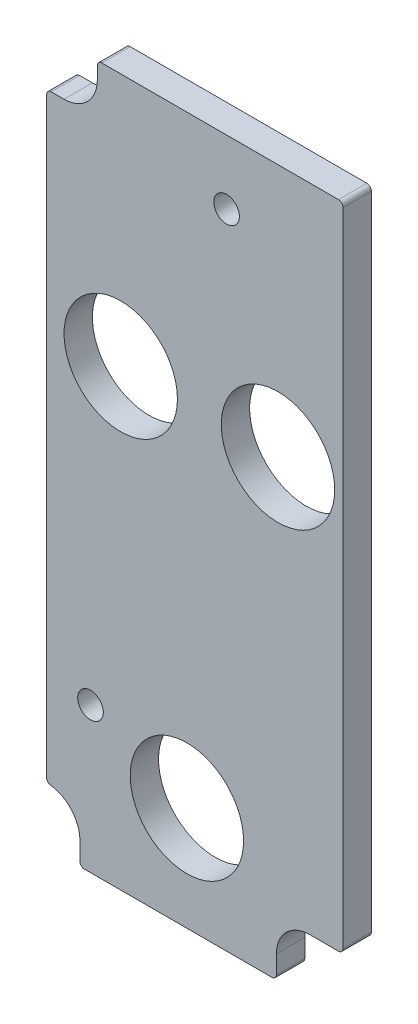
ISO-10303-21;
HEADER;
FILE_DESCRIPTION(('STEP AP214'),'2;1');
FILE_NAME('part.step','',(''),(''),'','','');
FILE_SCHEMA(('AUTOMOTIVE_DESIGN { 1 0 10303 214 1 1 1 1 }'));
ENDSEC;
DATA;
#1=APPLICATION_CONTEXT('core data for automotive mechanical design processes');
#2=APPLICATION_PROTOCOL_DEFINITION('international standard','automotive_design',2000,#1);
#3=PRODUCT_CONTEXT('',#1,'mechanical');
#4=PRODUCT('Part','Part','',(#3));
#5=PRODUCT_RELATED_PRODUCT_CATEGORY('part','',(#4));
#6=PRODUCT_DEFINITION_FORMATION('','',#4);
#7=PRODUCT_DEFINITION_CONTEXT('part definition',#1,'design');
#8=PRODUCT_DEFINITION('design','',#6,#7);
#9=PRODUCT_DEFINITION_SHAPE('','',#8);
#10=(LENGTH_UNIT() NAMED_UNIT(*) SI_UNIT(.MILLI.,.METRE.));
#11=(NAMED_UNIT(*) PLANE_ANGLE_UNIT() SI_UNIT($,.RADIAN.));
#12=(NAMED_UNIT(*) SI_UNIT($,.STERADIAN.) SOLID_ANGLE_UNIT());
#13=UNCERTAINTY_MEASURE_WITH_UNIT(LENGTH_MEASURE(1.E-05),#10,'distance_accuracy_value','');
#14=(GEOMETRIC_REPRESENTATION_CONTEXT(3) GLOBAL_UNCERTAINTY_ASSIGNED_CONTEXT((#13)) GLOBAL_UNIT_ASSIGNED_CONTEXT((#10,
#11,#12)) REPRESENTATION_CONTEXT('',''));
#15=CARTESIAN_POINT('',(0.,0.,0.));
#16=DIRECTION('',(0.,0.,1.));
#17=DIRECTION('',(1.,0.,0.));
#18=AXIS2_PLACEMENT_3D('',#15,#16,#17);
#19=CARTESIAN_POINT('',(-1.524,22.86,4.7625));
#20=DIRECTION('',(0.,0.,-1.));
#21=DIRECTION('',(-1.,0.,0.));
#22=AXIS2_PLACEMENT_3D('',#19,#20,#21);
#23=CYLINDRICAL_SURFACE('',#22,0.761999999999999);
#24=CARTESIAN_POINT('',(-1.524,22.86,0.));
#25=DIRECTION('',(0.,0.,1.));
#26=DIRECTION('',(1.,0.,0.));
#27=AXIS2_PLACEMENT_3D('',#24,#25,#26);
#28=CIRCLE('',#27,0.761999999999999);
#29=CARTESIAN_POINT('',(-1.524,22.098,0.));
#30=VERTEX_POINT('',#29);
#31=CARTESIAN_POINT('',(-0.761999999999998,22.86,0.));
#32=VERTEX_POINT('',#31);
#33=EDGE_CURVE('E221',#30,#32,#28,.T.);
#34=ORIENTED_EDGE('',*,*,#33,.T.);
#35=DIRECTION('',(0.,0.,-1.));
#36=VECTOR('',#35,1.);
#37=CARTESIAN_POINT('',(-0.761999999999998,22.86,4.7625));
#38=LINE('',#37,#36);
#39=CARTESIAN_POINT('',(-0.761999999999998,22.86,4.7625));
#40=VERTEX_POINT('',#39);
#41=EDGE_CURVE('E11',#40,#32,#38,.T.);
#42=ORIENTED_EDGE('',*,*,#41,.F.);
#43=CARTESIAN_POINT('',(-1.524,22.86,4.7625));
#44=DIRECTION('',(0.,0.,1.));
#45=DIRECTION('',(1.,0.,0.));
#46=AXIS2_PLACEMENT_3D('',#43,#44,#45);
#47=CIRCLE('',#46,0.761999999999999);
#48=CARTESIAN_POINT('',(-1.524,22.098,4.7625));
#49=VERTEX_POINT('',#48);
#50=EDGE_CURVE('E270',#49,#40,#47,.T.);
#51=ORIENTED_EDGE('',*,*,#50,.F.);
#52=DIRECTION('',(0.,0.,-1.));
#53=VECTOR('',#52,1.);
#54=CARTESIAN_POINT('',(-1.524,22.098,4.7625));
#55=LINE('',#54,#53);
#56=EDGE_CURVE('E217',#49,#30,#55,.T.);
#57=ORIENTED_EDGE('',*,*,#56,.T.);
#58=EDGE_LOOP('',(#34,#42,#51,#57));
#59=FACE_BOUND('',#58,.T.);
#60=ADVANCED_FACE('F36',(#59),#23,.T.);
#61=CARTESIAN_POINT('',(-0.761999999999998,22.86,4.7625));
#62=DIRECTION('',(-1.,0.,0.));
#63=DIRECTION('',(0.,-1.,0.));
#64=AXIS2_PLACEMENT_3D('',#61,#62,#63);
#65=PLANE('',#64);
#66=DIRECTION('',(0.,1.,0.));
#67=VECTOR('',#66,1.);
#68=CARTESIAN_POINT('',(-0.761999999999998,22.86,0.));
#69=LINE('',#68,#67);
#70=CARTESIAN_POINT('',(-0.761999999999996,130.683,0.));
#71=VERTEX_POINT('',#70);
#72=EDGE_CURVE('E225',#32,#71,#69,.T.);
#73=ORIENTED_EDGE('',*,*,#72,.T.);
#74=DIRECTION('',(0.,0.,-1.));
#75=VECTOR('',#74,1.);
#76=CARTESIAN_POINT('',(-0.761999999999996,130.683,4.7625));
#77=LINE('',#76,#75);
#78=CARTESIAN_POINT('',(-0.761999999999996,130.683,4.7625));
#79=VERTEX_POINT('',#78);
#80=EDGE_CURVE('E44',#79,#71,#77,.T.);
#81=ORIENTED_EDGE('',*,*,#80,.F.);
#82=DIRECTION('',(0.,1.,0.));
#83=VECTOR('',#82,1.);
#84=CARTESIAN_POINT('',(-0.761999999999998,22.86,4.7625));
#85=LINE('',#84,#83);
#86=EDGE_CURVE('E140',#40,#79,#85,.T.);
#87=ORIENTED_EDGE('',*,*,#86,.F.);
#88=ORIENTED_EDGE('',*,*,#41,.T.);
#89=EDGE_LOOP('',(#73,#81,#87,#88));
#90=FACE_BOUND('',#89,.T.);
#91=ADVANCED_FACE('F416',(#90),#65,.F.);
#92=CARTESIAN_POINT('',(-1.52399999999998,130.683,4.7625));
#93=DIRECTION('',(0.,0.,-1.));
#94=DIRECTION('',(-1.,0.,0.));
#95=AXIS2_PLACEMENT_3D('',#92,#93,#94);
#96=CYLINDRICAL_SURFACE('',#95,0.761999999999989);
#97=CARTESIAN_POINT('',(-1.52399999999998,130.683,0.));
#98=DIRECTION('',(0.,0.,1.));
#99=DIRECTION('',(1.,0.,0.));
#100=AXIS2_PLACEMENT_3D('',#97,#98,#99);
#101=CIRCLE('',#100,0.761999999999989);
#102=CARTESIAN_POINT('',(-1.52399999999998,131.445,0.));
#103=VERTEX_POINT('',#102);
#104=EDGE_CURVE('E229',#71,#103,#101,.T.);
#105=ORIENTED_EDGE('',*,*,#104,.T.);
#106=DIRECTION('',(0.,0.,-1.));
#107=VECTOR('',#106,1.);
#108=CARTESIAN_POINT('',(-1.52399999999998,131.445,4.7625));
#109=LINE('',#108,#107);
#110=CARTESIAN_POINT('',(-1.52399999999998,131.445,4.7625));
#111=VERTEX_POINT('',#110);
#112=EDGE_CURVE('E317',#111,#103,#109,.T.);
#113=ORIENTED_EDGE('',*,*,#112,.F.);
#114=CARTESIAN_POINT('',(-1.52399999999998,130.683,4.7625));
#115=DIRECTION('',(0.,0.,1.));
#116=DIRECTION('',(1.,0.,0.));
#117=AXIS2_PLACEMENT_3D('',#114,#115,#116);
#118=CIRCLE('',#117,0.761999999999989);
#119=EDGE_CURVE('E325',#79,#111,#118,.T.);
#120=ORIENTED_EDGE('',*,*,#119,.F.);
#121=ORIENTED_EDGE('',*,*,#80,.T.);
#122=EDGE_LOOP('',(#105,#113,#120,#121));
#123=FACE_BOUND('',#122,.T.);
#124=ADVANCED_FACE('F323',(#123),#96,.T.);
#125=CARTESIAN_POINT('',(-1.52399999999998,131.445,4.7625));
#126=DIRECTION('',(0.,-1.,0.));
#127=DIRECTION('',(0.,0.,-1.));
#128=AXIS2_PLACEMENT_3D('',#125,#126,#127);
#129=PLANE('',#128);
#130=DIRECTION('',(-1.,0.,0.));
#131=VECTOR('',#130,1.);
#132=CARTESIAN_POINT('',(-1.52399999999998,131.445,0.));
#133=LINE('',#132,#131);
#134=CARTESIAN_POINT('',(-41.275,131.445,0.));
#135=VERTEX_POINT('',#134);
#136=EDGE_CURVE('E231',#103,#135,#133,.T.);
#137=ORIENTED_EDGE('',*,*,#136,.T.);
#138=DIRECTION('',(0.,0.,-1.));
#139=VECTOR('',#138,1.);
#140=CARTESIAN_POINT('',(-41.275,131.445,4.7625));
#141=LINE('',#140,#139);
#142=CARTESIAN_POINT('',(-41.275,131.445,4.7625));
#143=VERTEX_POINT('',#142);
#144=EDGE_CURVE('E314',#143,#135,#141,.T.);
#145=ORIENTED_EDGE('',*,*,#144,.F.);
#146=DIRECTION('',(-1.,0.,0.));
#147=VECTOR('',#146,1.);
#148=CARTESIAN_POINT('',(-1.52399999999998,131.445,4.7625));
#149=LINE('',#148,#147);
#150=EDGE_CURVE('E343',#111,#143,#149,.T.);
#151=ORIENTED_EDGE('',*,*,#150,.F.);
#152=ORIENTED_EDGE('',*,*,#112,.T.);
#153=EDGE_LOOP('',(#137,#145,#151,#152));
#154=FACE_BOUND('',#153,.T.);
#155=ADVANCED_FACE('F334',(#154),#129,.F.);
#156=CARTESIAN_POINT('',(-41.275,130.683,4.7625));
#157=DIRECTION('',(0.,0.,-1.));
#158=DIRECTION('',(-1.,0.,0.));
#159=AXIS2_PLACEMENT_3D('',#156,#157,#158);
#160=CYLINDRICAL_SURFACE('',#159,0.761999999999988);
#161=CARTESIAN_POINT('',(-41.275,130.683,0.));
#162=DIRECTION('',(0.,0.,1.));
#163=DIRECTION('',(1.,0.,0.));
#164=AXIS2_PLACEMENT_3D('',#161,#162,#163);
#165=CIRCLE('',#164,0.761999999999988);
#166=CARTESIAN_POINT('',(-42.037,130.683,0.));
#167=VERTEX_POINT('',#166);
#168=EDGE_CURVE('E233',#135,#167,#165,.T.);
#169=ORIENTED_EDGE('',*,*,#168,.T.);
#170=DIRECTION('',(0.,0.,-1.));
#171=VECTOR('',#170,1.);
#172=CARTESIAN_POINT('',(-42.037,130.683,4.7625));
#173=LINE('',#172,#171);
#174=CARTESIAN_POINT('',(-42.037,130.683,4.7625));
#175=VERTEX_POINT('',#174);
#176=EDGE_CURVE('E311',#175,#167,#173,.T.);
#177=ORIENTED_EDGE('',*,*,#176,.F.);
#178=CARTESIAN_POINT('',(-41.275,130.683,4.7625));
#179=DIRECTION('',(0.,0.,1.));
#180=DIRECTION('',(1.,0.,0.));
#181=AXIS2_PLACEMENT_3D('',#178,#179,#180);
#182=CIRCLE('',#181,0.761999999999988);
#183=EDGE_CURVE('E340',#143,#175,#182,.T.);
#184=ORIENTED_EDGE('',*,*,#183,.F.);
#185=ORIENTED_EDGE('',*,*,#144,.T.);
#186=EDGE_LOOP('',(#169,#177,#184,#185));
#187=FACE_BOUND('',#186,.T.);
#188=ADVANCED_FACE('F338',(#187),#160,.T.);
#189=CARTESIAN_POINT('',(-42.037,130.683,4.7625));
#190=DIRECTION('',(1.,0.,0.));
#191=DIRECTION('',(0.,1.,0.));
#192=AXIS2_PLACEMENT_3D('',#189,#190,#191);
#193=PLANE('',#192);
#194=DIRECTION('',(0.,-1.,0.));
#195=VECTOR('',#194,1.);
#196=CARTESIAN_POINT('',(-42.037,130.683,0.));
#197=LINE('',#196,#195);
#198=CARTESIAN_POINT('',(-42.037,128.5875,0.));
#199=VERTEX_POINT('',#198);
#200=EDGE_CURVE('E235',#167,#199,#197,.T.);
#201=ORIENTED_EDGE('',*,*,#200,.T.);
#202=DIRECTION('',(0.,0.,-1.));
#203=VECTOR('',#202,1.);
#204=CARTESIAN_POINT('',(-42.037,128.5875,4.7625));
#205=LINE('',#204,#203);
#206=CARTESIAN_POINT('',(-42.037,128.5875,4.7625));
#207=VERTEX_POINT('',#206);
#208=EDGE_CURVE('E308',#207,#199,#205,.T.);
#209=ORIENTED_EDGE('',*,*,#208,.F.);
#210=DIRECTION('',(0.,-1.,0.));
#211=VECTOR('',#210,1.);
#212=CARTESIAN_POINT('',(-42.037,130.683,4.7625));
#213=LINE('',#212,#211);
#214=EDGE_CURVE('E342',#175,#207,#213,.T.);
#215=ORIENTED_EDGE('',*,*,#214,.F.);
#216=ORIENTED_EDGE('',*,*,#176,.T.);
#217=EDGE_LOOP('',(#201,#209,#215,#216));
#218=FACE_BOUND('',#217,.T.);
#219=ADVANCED_FACE('F428',(#218),#193,.F.);
#220=CARTESIAN_POINT('',(-47.625,128.5875,4.7625));
#221=DIRECTION('',(0.,0.,-1.));
#222=DIRECTION('',(-1.,0.,0.));
#223=AXIS2_PLACEMENT_3D('',#220,#221,#222);
#224=CYLINDRICAL_SURFACE('',#223,5.58799999999998);
#225=CARTESIAN_POINT('',(-47.625,128.5875,0.));
#226=DIRECTION('',(0.,0.,-1.));
#227=DIRECTION('',(1.,0.,0.));
#228=AXIS2_PLACEMENT_3D('',#225,#226,#227);
#229=CIRCLE('',#228,5.58799999999998);
#230=CARTESIAN_POINT('',(-47.625,122.9995,0.));
#231=VERTEX_POINT('',#230);
#232=EDGE_CURVE('E237',#199,#231,#229,.T.);
#233=ORIENTED_EDGE('',*,*,#232,.T.);
#234=DIRECTION('',(0.,0.,-1.));
#235=VECTOR('',#234,1.);
#236=CARTESIAN_POINT('',(-47.625,122.9995,4.7625));
#237=LINE('',#236,#235);
#238=CARTESIAN_POINT('',(-47.625,122.9995,4.7625));
#239=VERTEX_POINT('',#238);
#240=EDGE_CURVE('E305',#239,#231,#237,.T.);
#241=ORIENTED_EDGE('',*,*,#240,.F.);
#242=CARTESIAN_POINT('',(-47.625,128.5875,4.7625));
#243=DIRECTION('',(0.,0.,-1.));
#244=DIRECTION('',(1.,0.,0.));
#245=AXIS2_PLACEMENT_3D('',#242,#243,#244);
#246=CIRCLE('',#245,5.58799999999998);
#247=EDGE_CURVE('E345',#207,#239,#246,.T.);
#248=ORIENTED_EDGE('',*,*,#247,.F.);
#249=ORIENTED_EDGE('',*,*,#208,.T.);
#250=EDGE_LOOP('',(#233,#241,#248,#249));
#251=FACE_BOUND('',#250,.T.);
#252=ADVANCED_FACE('F431',(#251),#224,.F.);
#253=CARTESIAN_POINT('',(-47.625,122.9995,4.7625));
#254=DIRECTION('',(0.,-1.,0.));
#255=DIRECTION('',(1.,0.,0.));
#256=AXIS2_PLACEMENT_3D('',#253,#254,#255);
#257=PLANE('',#256);
#258=DIRECTION('',(-1.,0.,0.));
#259=VECTOR('',#258,1.);
#260=CARTESIAN_POINT('',(-47.625,122.9995,0.));
#261=LINE('',#260,#259);
#262=CARTESIAN_POINT('',(-49.784,122.9995,0.));
#263=VERTEX_POINT('',#262);
#264=EDGE_CURVE('E239',#231,#263,#261,.T.);
#265=ORIENTED_EDGE('',*,*,#264,.T.);
#266=DIRECTION('',(0.,0.,-1.));
#267=VECTOR('',#266,1.);
#268=CARTESIAN_POINT('',(-49.784,122.9995,4.7625));
#269=LINE('',#268,#267);
#270=CARTESIAN_POINT('',(-49.784,122.9995,4.7625));
#271=VERTEX_POINT('',#270);
#272=EDGE_CURVE('E302',#271,#263,#269,.T.);
#273=ORIENTED_EDGE('',*,*,#272,.F.);
#274=DIRECTION('',(-1.,0.,0.));
#275=VECTOR('',#274,1.);
#276=CARTESIAN_POINT('',(-47.625,122.9995,4.7625));
#277=LINE('',#276,#275);
#278=EDGE_CURVE('E351',#239,#271,#277,.T.);
#279=ORIENTED_EDGE('',*,*,#278,.F.);
#280=ORIENTED_EDGE('',*,*,#240,.T.);
#281=EDGE_LOOP('',(#265,#273,#279,#280));
#282=FACE_BOUND('',#281,.T.);
#283=ADVANCED_FACE('F435',(#282),#257,.F.);
#284=CARTESIAN_POINT('',(-49.784,122.2375,4.7625));
#285=DIRECTION('',(0.,0.,-1.));
#286=DIRECTION('',(-1.,0.,0.));
#287=AXIS2_PLACEMENT_3D('',#284,#285,#286);
#288=CYLINDRICAL_SURFACE('',#287,0.76200000000002);
#289=CARTESIAN_POINT('',(-49.784,122.2375,0.));
#290=DIRECTION('',(0.,0.,1.));
#291=DIRECTION('',(1.,0.,0.));
#292=AXIS2_PLACEMENT_3D('',#289,#290,#291);
#293=CIRCLE('',#292,0.76200000000002);
#294=CARTESIAN_POINT('',(-50.546,122.2375,0.));
#295=VERTEX_POINT('',#294);
#296=EDGE_CURVE('E241',#263,#295,#293,.T.);
#297=ORIENTED_EDGE('',*,*,#296,.T.);
#298=DIRECTION('',(0.,0.,-1.));
#299=VECTOR('',#298,1.);
#300=CARTESIAN_POINT('',(-50.546,122.2375,4.7625));
#301=LINE('',#300,#299);
#302=CARTESIAN_POINT('',(-50.546,122.2375,4.7625));
#303=VERTEX_POINT('',#302);
#304=EDGE_CURVE('E299',#303,#295,#301,.T.);
#305=ORIENTED_EDGE('',*,*,#304,.F.);
#306=CARTESIAN_POINT('',(-49.784,122.2375,4.7625));
#307=DIRECTION('',(0.,0.,1.));
#308=DIRECTION('',(1.,0.,0.));
#309=AXIS2_PLACEMENT_3D('',#306,#307,#308);
#310=CIRCLE('',#309,0.76200000000002);
#311=EDGE_CURVE('E353',#271,#303,#310,.T.);
#312=ORIENTED_EDGE('',*,*,#311,.F.);
#313=ORIENTED_EDGE('',*,*,#272,.T.);
#314=EDGE_LOOP('',(#297,#305,#312,#313));
#315=FACE_BOUND('',#314,.T.);
#316=ADVANCED_FACE('F439',(#315),#288,.T.);
#317=CARTESIAN_POINT('',(-50.546,122.2375,4.7625));
#318=DIRECTION('',(1.,0.,0.));
#319=DIRECTION('',(0.,1.,0.));
#320=AXIS2_PLACEMENT_3D('',#317,#318,#319);
#321=PLANE('',#320);
#322=DIRECTION('',(0.,-1.,0.));
#323=VECTOR('',#322,1.);
#324=CARTESIAN_POINT('',(-50.546,122.2375,0.));
#325=LINE('',#324,#323);
#326=CARTESIAN_POINT('',(-50.546,22.8141142121634,0.));
#327=VERTEX_POINT('',#326);
#328=EDGE_CURVE('E243',#295,#327,#325,.T.);
#329=ORIENTED_EDGE('',*,*,#328,.T.);
#330=DIRECTION('',(0.,0.,-1.));
#331=VECTOR('',#330,1.);
#332=CARTESIAN_POINT('',(-50.546,22.8141142121634,4.7625));
#333=LINE('',#332,#331);
#334=CARTESIAN_POINT('',(-50.546,22.8141142121634,4.7625));
#335=VERTEX_POINT('',#334);
#336=EDGE_CURVE('E295',#335,#327,#333,.T.);
#337=ORIENTED_EDGE('',*,*,#336,.F.);
#338=DIRECTION('',(0.,-1.,0.));
#339=VECTOR('',#338,1.);
#340=CARTESIAN_POINT('',(-50.546,122.2375,4.7625));
#341=LINE('',#340,#339);
#342=EDGE_CURVE('E355',#303,#335,#341,.T.);
#343=ORIENTED_EDGE('',*,*,#342,.F.);
#344=ORIENTED_EDGE('',*,*,#304,.T.);
#345=EDGE_LOOP('',(#329,#337,#343,#344));
#346=FACE_BOUND('',#345,.T.);
#347=ADVANCED_FACE('F443',(#346),#321,.F.);
#348=CARTESIAN_POINT('',(-49.784,22.8141142121634,4.7625));
#349=DIRECTION('',(0.,0.,-1.));
#350=DIRECTION('',(-1.,0.,0.));
#351=AXIS2_PLACEMENT_3D('',#348,#349,#350);
#352=CYLINDRICAL_SURFACE('',#351,0.762000000000004);
#353=CARTESIAN_POINT('',(-49.784,22.8141142121634,0.));
#354=DIRECTION('',(0.,0.,1.));
#355=DIRECTION('',(1.,0.,0.));
#356=AXIS2_PLACEMENT_3D('',#353,#354,#355);
#357=CIRCLE('',#356,0.762000000000004);
#358=CARTESIAN_POINT('',(-49.87544,22.0576205067037,0.));
#359=VERTEX_POINT('',#358);
#360=EDGE_CURVE('E246',#327,#359,#357,.T.);
#361=ORIENTED_EDGE('',*,*,#360,.T.);
#362=DIRECTION('',(0.,0.,-1.));
#363=VECTOR('',#362,1.);
#364=CARTESIAN_POINT('',(-49.87544,22.0576205067037,4.7625));
#365=LINE('',#364,#363);
#366=CARTESIAN_POINT('',(-49.87544,22.0576205067037,4.7625));
#367=VERTEX_POINT('',#366);
#368=EDGE_CURVE('E291',#367,#359,#365,.T.);
#369=ORIENTED_EDGE('',*,*,#368,.F.);
#370=CARTESIAN_POINT('',(-49.784,22.8141142121634,4.7625));
#371=DIRECTION('',(0.,0.,1.));
#372=DIRECTION('',(1.,0.,0.));
#373=AXIS2_PLACEMENT_3D('',#370,#371,#372);
#374=CIRCLE('',#373,0.762000000000004);
#375=EDGE_CURVE('E358',#335,#367,#374,.T.);
#376=ORIENTED_EDGE('',*,*,#375,.F.);
#377=ORIENTED_EDGE('',*,*,#336,.T.);
#378=EDGE_LOOP('',(#361,#369,#376,#377));
#379=FACE_BOUND('',#378,.T.);
#380=ADVANCED_FACE('F447',(#379),#352,.T.);
#381=CARTESIAN_POINT('',(-50.546,16.51,4.7625));
#382=DIRECTION('',(0.,0.,-1.));
#383=DIRECTION('',(-1.,0.,0.));
#384=AXIS2_PLACEMENT_3D('',#381,#382,#383);
#385=CYLINDRICAL_SURFACE('',#384,5.588);
#386=CARTESIAN_POINT('',(-50.546,16.51,0.));
#387=DIRECTION('',(0.,0.,-1.));
#388=DIRECTION('',(1.,0.,0.));
#389=AXIS2_PLACEMENT_3D('',#386,#387,#388);
#390=CIRCLE('',#389,5.588);
#391=CARTESIAN_POINT('',(-44.958,16.51,0.));
#392=VERTEX_POINT('',#391);
#393=EDGE_CURVE('E249',#359,#392,#390,.T.);
#394=ORIENTED_EDGE('',*,*,#393,.T.);
#395=DIRECTION('',(0.,0.,-1.));
#396=VECTOR('',#395,1.);
#397=CARTESIAN_POINT('',(-44.958,16.51,4.7625));
#398=LINE('',#397,#396);
#399=CARTESIAN_POINT('',(-44.958,16.51,4.7625));
#400=VERTEX_POINT('',#399);
#401=EDGE_CURVE('E287',#400,#392,#398,.T.);
#402=ORIENTED_EDGE('',*,*,#401,.F.);
#403=CARTESIAN_POINT('',(-50.546,16.51,4.7625));
#404=DIRECTION('',(0.,0.,-1.));
#405=DIRECTION('',(1.,0.,0.));
#406=AXIS2_PLACEMENT_3D('',#403,#404,#405);
#407=CIRCLE('',#406,5.588);
#408=EDGE_CURVE('E361',#367,#400,#407,.T.);
#409=ORIENTED_EDGE('',*,*,#408,.F.);
#410=ORIENTED_EDGE('',*,*,#368,.T.);
#411=EDGE_LOOP('',(#394,#402,#409,#410));
#412=FACE_BOUND('',#411,.T.);
#413=ADVANCED_FACE('F451',(#412),#385,.F.);
#414=CARTESIAN_POINT('',(-44.958,16.51,4.7625));
#415=DIRECTION('',(1.,0.,0.));
#416=DIRECTION('',(0.,0.,-1.));
#417=AXIS2_PLACEMENT_3D('',#414,#415,#416);
#418=PLANE('',#417);
#419=DIRECTION('',(0.,-1.,0.));
#420=VECTOR('',#419,1.);
#421=CARTESIAN_POINT('',(-44.958,16.51,0.));
#422=LINE('',#421,#420);
#423=CARTESIAN_POINT('',(-44.958,13.462,0.));
#424=VERTEX_POINT('',#423);
#425=EDGE_CURVE('E252',#392,#424,#422,.T.);
#426=ORIENTED_EDGE('',*,*,#425,.T.);
#427=DIRECTION('',(0.,0.,-1.));
#428=VECTOR('',#427,1.);
#429=CARTESIAN_POINT('',(-44.958,13.462,4.7625));
#430=LINE('',#429,#428);
#431=CARTESIAN_POINT('',(-44.958,13.462,4.7625));
#432=VERTEX_POINT('',#431);
#433=EDGE_CURVE('E283',#432,#424,#430,.T.);
#434=ORIENTED_EDGE('',*,*,#433,.F.);
#435=DIRECTION('',(0.,-1.,0.));
#436=VECTOR('',#435,1.);
#437=CARTESIAN_POINT('',(-44.958,16.51,4.7625));
#438=LINE('',#437,#436);
#439=EDGE_CURVE('E364',#400,#432,#438,.T.);
#440=ORIENTED_EDGE('',*,*,#439,.F.);
#441=ORIENTED_EDGE('',*,*,#401,.T.);
#442=EDGE_LOOP('',(#426,#434,#440,#441));
#443=FACE_BOUND('',#442,.T.);
#444=ADVANCED_FACE('F455',(#443),#418,.F.);
#445=CARTESIAN_POINT('',(-44.196,13.462,4.7625));
#446=DIRECTION('',(0.,0.,-1.));
#447=DIRECTION('',(-1.,0.,0.));
#448=AXIS2_PLACEMENT_3D('',#445,#446,#447);
#449=CYLINDRICAL_SURFACE('',#448,0.761999999999999);
#450=CARTESIAN_POINT('',(-44.196,13.462,0.));
#451=DIRECTION('',(0.,0.,1.));
#452=DIRECTION('',(1.,0.,0.));
#453=AXIS2_PLACEMENT_3D('',#450,#451,#452);
#454=CIRCLE('',#453,0.761999999999999);
#455=CARTESIAN_POINT('',(-44.196,12.7,0.));
#456=VERTEX_POINT('',#455);
#457=EDGE_CURVE('E255',#424,#456,#454,.T.);
#458=ORIENTED_EDGE('',*,*,#457,.T.);
#459=DIRECTION('',(0.,0.,-1.));
#460=VECTOR('',#459,1.);
#461=CARTESIAN_POINT('',(-44.196,12.7,4.7625));
#462=LINE('',#461,#460);
#463=CARTESIAN_POINT('',(-44.196,12.7,4.7625));
#464=VERTEX_POINT('',#463);
#465=EDGE_CURVE('E279',#464,#456,#462,.T.);
#466=ORIENTED_EDGE('',*,*,#465,.F.);
#467=CARTESIAN_POINT('',(-44.196,13.462,4.7625));
#468=DIRECTION('',(0.,0.,1.));
#469=DIRECTION('',(1.,0.,0.));
#470=AXIS2_PLACEMENT_3D('',#467,#468,#469);
#471=CIRCLE('',#470,0.761999999999999);
#472=EDGE_CURVE('E367',#432,#464,#471,.T.);
#473=ORIENTED_EDGE('',*,*,#472,.F.);
#474=ORIENTED_EDGE('',*,*,#433,.T.);
#475=EDGE_LOOP('',(#458,#466,#473,#474));
#476=FACE_BOUND('',#475,.T.);
#477=ADVANCED_FACE('F459',(#476),#449,.T.);
#478=CARTESIAN_POINT('',(-44.196,12.7,4.7625));
#479=DIRECTION('',(0.,1.,0.));
#480=DIRECTION('',(-1.,0.,0.));
#481=AXIS2_PLACEMENT_3D('',#478,#479,#480);
#482=PLANE('',#481);
#483=DIRECTION('',(1.,0.,0.));
#484=VECTOR('',#483,1.);
#485=CARTESIAN_POINT('',(-44.196,12.7,0.));
#486=LINE('',#485,#484);
#487=CARTESIAN_POINT('',(-12.7,12.7,0.));
#488=VERTEX_POINT('',#487);
#489=EDGE_CURVE('E258',#456,#488,#486,.T.);
#490=ORIENTED_EDGE('',*,*,#489,.T.);
#491=DIRECTION('',(0.,0.,-1.));
#492=VECTOR('',#491,1.);
#493=CARTESIAN_POINT('',(-12.7,12.7,4.7625));
#494=LINE('',#493,#492);
#495=CARTESIAN_POINT('',(-12.7,12.7,4.7625));
#496=VERTEX_POINT('',#495);
#497=EDGE_CURVE('E275',#496,#488,#494,.T.);
#498=ORIENTED_EDGE('',*,*,#497,.F.);
#499=DIRECTION('',(1.,0.,0.));
#500=VECTOR('',#499,1.);
#501=CARTESIAN_POINT('',(-44.196,12.7,4.7625));
#502=LINE('',#501,#500);
#503=EDGE_CURVE('E370',#464,#496,#502,.T.);
#504=ORIENTED_EDGE('',*,*,#503,.F.);
#505=ORIENTED_EDGE('',*,*,#465,.T.);
#506=EDGE_LOOP('',(#490,#498,#504,#505));
#507=FACE_BOUND('',#506,.T.);
#508=ADVANCED_FACE('F463',(#507),#482,.F.);
#509=CARTESIAN_POINT('',(-12.7,13.462,4.7625));
#510=DIRECTION('',(0.,0.,-1.));
#511=DIRECTION('',(-1.,0.,0.));
#512=AXIS2_PLACEMENT_3D('',#509,#510,#511);
#513=CYLINDRICAL_SURFACE('',#512,0.761999999999987);
#514=CARTESIAN_POINT('',(-12.7,13.462,0.));
#515=DIRECTION('',(0.,0.,1.));
#516=DIRECTION('',(1.,0.,0.));
#517=AXIS2_PLACEMENT_3D('',#514,#515,#516);
#518=CIRCLE('',#517,0.761999999999987);
#519=CARTESIAN_POINT('',(-11.938,13.462,0.));
#520=VERTEX_POINT('',#519);
#521=EDGE_CURVE('E261',#488,#520,#518,.T.);
#522=ORIENTED_EDGE('',*,*,#521,.T.);
#523=DIRECTION('',(0.,0.,-1.));
#524=VECTOR('',#523,1.);
#525=CARTESIAN_POINT('',(-11.938,13.462,4.7625));
#526=LINE('',#525,#524);
#527=CARTESIAN_POINT('',(-11.938,13.462,4.7625));
#528=VERTEX_POINT('',#527);
#529=EDGE_CURVE('E210',#528,#520,#526,.T.);
#530=ORIENTED_EDGE('',*,*,#529,.F.);
#531=CARTESIAN_POINT('',(-12.7,13.462,4.7625));
#532=DIRECTION('',(0.,0.,1.));
#533=DIRECTION('',(1.,0.,0.));
#534=AXIS2_PLACEMENT_3D('',#531,#532,#533);
#535=CIRCLE('',#534,0.761999999999987);
#536=EDGE_CURVE('E199',#496,#528,#535,.T.);
#537=ORIENTED_EDGE('',*,*,#536,.F.);
#538=ORIENTED_EDGE('',*,*,#497,.T.);
#539=EDGE_LOOP('',(#522,#530,#537,#538));
#540=FACE_BOUND('',#539,.T.);
#541=ADVANCED_FACE('F467',(#540),#513,.T.);
#542=CARTESIAN_POINT('',(-11.938,13.462,4.7625));
#543=DIRECTION('',(-1.,0.,0.));
#544=DIRECTION('',(0.,-1.,0.));
#545=AXIS2_PLACEMENT_3D('',#542,#543,#544);
#546=PLANE('',#545);
#547=DIRECTION('',(0.,1.,0.));
#548=VECTOR('',#547,1.);
#549=CARTESIAN_POINT('',(-11.938,13.462,0.));
#550=LINE('',#549,#548);
#551=CARTESIAN_POINT('',(-11.938,16.51,0.));
#552=VERTEX_POINT('',#551);
#553=EDGE_CURVE('E208',#520,#552,#550,.T.);
#554=ORIENTED_EDGE('',*,*,#553,.T.);
#555=DIRECTION('',(0.,0.,-1.));
#556=VECTOR('',#555,1.);
#557=CARTESIAN_POINT('',(-11.938,16.51,4.7625));
#558=LINE('',#557,#556);
#559=CARTESIAN_POINT('',(-11.938,16.51,4.7625));
#560=VERTEX_POINT('',#559);
#561=EDGE_CURVE('E205',#560,#552,#558,.T.);
#562=ORIENTED_EDGE('',*,*,#561,.F.);
#563=DIRECTION('',(0.,1.,0.));
#564=VECTOR('',#563,1.);
#565=CARTESIAN_POINT('',(-11.938,13.462,4.7625));
#566=LINE('',#565,#564);
#567=EDGE_CURVE('E193',#528,#560,#566,.T.);
#568=ORIENTED_EDGE('',*,*,#567,.F.);
#569=ORIENTED_EDGE('',*,*,#529,.T.);
#570=EDGE_LOOP('',(#554,#562,#568,#569));
#571=FACE_BOUND('',#570,.T.);
#572=ADVANCED_FACE('F206',(#571),#546,.F.);
#573=CARTESIAN_POINT('',(-6.35,16.51,4.7625));
#574=DIRECTION('',(0.,0.,-1.));
#575=DIRECTION('',(-1.,0.,0.));
#576=AXIS2_PLACEMENT_3D('',#573,#574,#575);
#577=CYLINDRICAL_SURFACE('',#576,5.588);
#578=CARTESIAN_POINT('',(-6.35,16.51,0.));
#579=DIRECTION('',(0.,0.,-1.));
#580=DIRECTION('',(1.,0.,0.));
#581=AXIS2_PLACEMENT_3D('',#578,#579,#580);
#582=CIRCLE('',#581,5.588);
#583=CARTESIAN_POINT('',(-6.35,22.098,0.));
#584=VERTEX_POINT('',#583);
#585=EDGE_CURVE('E125',#552,#584,#582,.T.);
#586=ORIENTED_EDGE('',*,*,#585,.T.);
#587=DIRECTION('',(0.,0.,-1.));
#588=VECTOR('',#587,1.);
#589=CARTESIAN_POINT('',(-6.35,22.098,4.7625));
#590=LINE('',#589,#588);
#591=CARTESIAN_POINT('',(-6.35,22.098,4.7625));
#592=VERTEX_POINT('',#591);
#593=EDGE_CURVE('E211',#592,#584,#590,.T.);
#594=ORIENTED_EDGE('',*,*,#593,.F.);
#595=CARTESIAN_POINT('',(-6.35,16.51,4.7625));
#596=DIRECTION('',(0.,0.,-1.));
#597=DIRECTION('',(1.,0.,0.));
#598=AXIS2_PLACEMENT_3D('',#595,#596,#597);
#599=CIRCLE('',#598,5.588);
#600=EDGE_CURVE('E197',#560,#592,#599,.T.);
#601=ORIENTED_EDGE('',*,*,#600,.F.);
#602=ORIENTED_EDGE('',*,*,#561,.T.);
#603=EDGE_LOOP('',(#586,#594,#601,#602));
#604=FACE_BOUND('',#603,.T.);
#605=ADVANCED_FACE('F213',(#604),#577,.F.);
#606=CARTESIAN_POINT('',(-6.35,22.098,4.7625));
#607=DIRECTION('',(0.,1.,0.));
#608=DIRECTION('',(0.,0.,1.));
#609=AXIS2_PLACEMENT_3D('',#606,#607,#608);
#610=PLANE('',#609);
#611=DIRECTION('',(1.,0.,0.));
#612=VECTOR('',#611,1.);
#613=CARTESIAN_POINT('',(-6.35,22.098,0.));
#614=LINE('',#613,#612);
#615=EDGE_CURVE('E132',#584,#30,#614,.T.);
#616=ORIENTED_EDGE('',*,*,#615,.T.);
#617=ORIENTED_EDGE('',*,*,#56,.F.);
#618=DIRECTION('',(1.,0.,0.));
#619=VECTOR('',#618,1.);
#620=CARTESIAN_POINT('',(-6.35,22.098,4.7625));
#621=LINE('',#620,#619);
#622=EDGE_CURVE('E52',#592,#49,#621,.T.);
#623=ORIENTED_EDGE('',*,*,#622,.F.);
#624=ORIENTED_EDGE('',*,*,#593,.T.);
#625=EDGE_LOOP('',(#616,#617,#623,#624));
#626=FACE_BOUND('',#625,.T.);
#627=ADVANCED_FACE('F476',(#626),#610,.F.);
#628=CARTESIAN_POINT('',(-1.524,22.86,4.7625));
#629=DIRECTION('',(0.,0.,1.));
#630=DIRECTION('',(1.,0.,0.));
#631=AXIS2_PLACEMENT_3D('',#628,#629,#630);
#632=PLANE('',#631);
#633=CARTESIAN_POINT('',(-20.32,120.65,4.7625));
#634=DIRECTION('',(0.,0.,1.));
#635=DIRECTION('',(1.,0.,0.));
#636=AXIS2_PLACEMENT_3D('',#633,#634,#635);
#637=CIRCLE('',#636,2.15265);
#638=CARTESIAN_POINT('',(-18.16735,120.65,4.7625));
#639=VERTEX_POINT('',#638);
#640=EDGE_CURVE('E394',#639,#639,#637,.T.);
#641=ORIENTED_EDGE('',*,*,#640,.F.);
#642=EDGE_LOOP('',(#641));
#643=FACE_BOUND('',#642,.T.);
#644=CARTESIAN_POINT('',(-43.18,37.084,4.7625));
#645=DIRECTION('',(0.,0.,1.));
#646=DIRECTION('',(1.,0.,0.));
#647=AXIS2_PLACEMENT_3D('',#644,#645,#646);
#648=CIRCLE('',#647,2.15264999999999);
#649=CARTESIAN_POINT('',(-41.02735,37.084,4.7625));
#650=VERTEX_POINT('',#649);
#651=EDGE_CURVE('E377',#650,#650,#648,.T.);
#652=ORIENTED_EDGE('',*,*,#651,.F.);
#653=EDGE_LOOP('',(#652));
#654=FACE_BOUND('',#653,.T.);
#655=CARTESIAN_POINT('',(-38.1,88.9,4.7625));
#656=DIRECTION('',(0.,0.,1.));
#657=DIRECTION('',(1.,0.,0.));
#658=AXIS2_PLACEMENT_3D('',#655,#656,#657);
#659=CIRCLE('',#658,9.525);
#660=CARTESIAN_POINT('',(-28.575,88.9,4.7625));
#661=VERTEX_POINT('',#660);
#662=EDGE_CURVE('E376',#661,#661,#659,.T.);
#663=ORIENTED_EDGE('',*,*,#662,.F.);
#664=EDGE_LOOP('',(#663));
#665=FACE_BOUND('',#664,.T.);
#666=CARTESIAN_POINT('',(-11.684,88.9,4.7625));
#667=DIRECTION('',(0.,0.,1.));
#668=DIRECTION('',(1.,0.,0.));
#669=AXIS2_PLACEMENT_3D('',#666,#667,#668);
#670=CIRCLE('',#669,9.525);
#671=CARTESIAN_POINT('',(-2.159,88.9,4.7625));
#672=VERTEX_POINT('',#671);
#673=EDGE_CURVE('E405',#672,#672,#670,.T.);
#674=ORIENTED_EDGE('',*,*,#673,.F.);
#675=EDGE_LOOP('',(#674));
#676=FACE_BOUND('',#675,.T.);
#677=CARTESIAN_POINT('',(-26.9875,30.1625,4.7625));
#678=DIRECTION('',(0.,0.,1.));
#679=DIRECTION('',(1.,0.,0.));
#680=AXIS2_PLACEMENT_3D('',#677,#678,#679);
#681=CIRCLE('',#680,9.525);
#682=CARTESIAN_POINT('',(-17.4625,30.1625,4.7625));
#683=VERTEX_POINT('',#682);
#684=EDGE_CURVE('E381',#683,#683,#681,.T.);
#685=ORIENTED_EDGE('',*,*,#684,.F.);
#686=EDGE_LOOP('',(#685));
#687=FACE_BOUND('',#686,.T.);
#688=ORIENTED_EDGE('',*,*,#50,.T.);
#689=ORIENTED_EDGE('',*,*,#86,.T.);
#690=ORIENTED_EDGE('',*,*,#119,.T.);
#691=ORIENTED_EDGE('',*,*,#150,.T.);
#692=ORIENTED_EDGE('',*,*,#183,.T.);
#693=ORIENTED_EDGE('',*,*,#214,.T.);
#694=ORIENTED_EDGE('',*,*,#247,.T.);
#695=ORIENTED_EDGE('',*,*,#278,.T.);
#696=ORIENTED_EDGE('',*,*,#311,.T.);
#697=ORIENTED_EDGE('',*,*,#342,.T.);
#698=ORIENTED_EDGE('',*,*,#375,.T.);
#699=ORIENTED_EDGE('',*,*,#408,.T.);
#700=ORIENTED_EDGE('',*,*,#439,.T.);
#701=ORIENTED_EDGE('',*,*,#472,.T.);
#702=ORIENTED_EDGE('',*,*,#503,.T.);
#703=ORIENTED_EDGE('',*,*,#536,.T.);
#704=ORIENTED_EDGE('',*,*,#567,.T.);
#705=ORIENTED_EDGE('',*,*,#600,.T.);
#706=ORIENTED_EDGE('',*,*,#622,.T.);
#707=EDGE_LOOP('',(#688,#689,#690,#691,#692,#693,#694,#695,#696,#697,#698,#699,#700,#701,#702,
#703,#704,#705,#706));
#708=FACE_BOUND('',#707,.T.);
#709=ADVANCED_FACE('F195',(#643,#654,#665,#676,#687,#708),#632,.T.);
#710=CARTESIAN_POINT('',(-1.524,22.86,0.));
#711=DIRECTION('',(0.,0.,1.));
#712=DIRECTION('',(1.,0.,0.));
#713=AXIS2_PLACEMENT_3D('',#710,#711,#712);
#714=PLANE('',#713);
#715=CARTESIAN_POINT('',(-20.32,120.65,0.));
#716=DIRECTION('',(0.,0.,1.));
#717=DIRECTION('',(1.,0.,0.));
#718=AXIS2_PLACEMENT_3D('',#715,#716,#717);
#719=CIRCLE('',#718,2.15265);
#720=CARTESIAN_POINT('',(-18.16735,120.65,0.));
#721=VERTEX_POINT('',#720);
#722=EDGE_CURVE('E389',#721,#721,#719,.T.);
#723=ORIENTED_EDGE('',*,*,#722,.T.);
#724=EDGE_LOOP('',(#723));
#725=FACE_BOUND('',#724,.T.);
#726=CARTESIAN_POINT('',(-43.18,37.084,0.));
#727=DIRECTION('',(0.,0.,1.));
#728=DIRECTION('',(1.,0.,0.));
#729=AXIS2_PLACEMENT_3D('',#726,#727,#728);
#730=CIRCLE('',#729,2.15265);
#731=CARTESIAN_POINT('',(-41.02735,37.084,0.));
#732=VERTEX_POINT('',#731);
#733=EDGE_CURVE('E374',#732,#732,#730,.T.);
#734=ORIENTED_EDGE('',*,*,#733,.T.);
#735=EDGE_LOOP('',(#734));
#736=FACE_BOUND('',#735,.T.);
#737=CARTESIAN_POINT('',(-38.1,88.9,0.));
#738=DIRECTION('',(0.,0.,1.));
#739=DIRECTION('',(1.,0.,0.));
#740=AXIS2_PLACEMENT_3D('',#737,#738,#739);
#741=CIRCLE('',#740,9.525);
#742=CARTESIAN_POINT('',(-28.575,88.9,0.));
#743=VERTEX_POINT('',#742);
#744=EDGE_CURVE('E401',#743,#743,#741,.T.);
#745=ORIENTED_EDGE('',*,*,#744,.T.);
#746=EDGE_LOOP('',(#745));
#747=FACE_BOUND('',#746,.T.);
#748=CARTESIAN_POINT('',(-11.684,88.9,0.));
#749=DIRECTION('',(0.,0.,1.));
#750=DIRECTION('',(1.,0.,0.));
#751=AXIS2_PLACEMENT_3D('',#748,#749,#750);
#752=CIRCLE('',#751,9.525);
#753=CARTESIAN_POINT('',(-2.159,88.9,0.));
#754=VERTEX_POINT('',#753);
#755=EDGE_CURVE('E385',#754,#754,#752,.T.);
#756=ORIENTED_EDGE('',*,*,#755,.T.);
#757=EDGE_LOOP('',(#756));
#758=FACE_BOUND('',#757,.T.);
#759=CARTESIAN_POINT('',(-26.9875,30.1625,0.));
#760=DIRECTION('',(0.,0.,1.));
#761=DIRECTION('',(1.,0.,0.));
#762=AXIS2_PLACEMENT_3D('',#759,#760,#761);
#763=CIRCLE('',#762,9.525);
#764=CARTESIAN_POINT('',(-17.4625,30.1625,0.));
#765=VERTEX_POINT('',#764);
#766=EDGE_CURVE('E226',#765,#765,#763,.T.);
#767=ORIENTED_EDGE('',*,*,#766,.T.);
#768=EDGE_LOOP('',(#767));
#769=FACE_BOUND('',#768,.T.);
#770=ORIENTED_EDGE('',*,*,#33,.F.);
#771=ORIENTED_EDGE('',*,*,#615,.F.);
#772=ORIENTED_EDGE('',*,*,#585,.F.);
#773=ORIENTED_EDGE('',*,*,#553,.F.);
#774=ORIENTED_EDGE('',*,*,#521,.F.);
#775=ORIENTED_EDGE('',*,*,#489,.F.);
#776=ORIENTED_EDGE('',*,*,#457,.F.);
#777=ORIENTED_EDGE('',*,*,#425,.F.);
#778=ORIENTED_EDGE('',*,*,#393,.F.);
#779=ORIENTED_EDGE('',*,*,#360,.F.);
#780=ORIENTED_EDGE('',*,*,#328,.F.);
#781=ORIENTED_EDGE('',*,*,#296,.F.);
#782=ORIENTED_EDGE('',*,*,#264,.F.);
#783=ORIENTED_EDGE('',*,*,#232,.F.);
#784=ORIENTED_EDGE('',*,*,#200,.F.);
#785=ORIENTED_EDGE('',*,*,#168,.F.);
#786=ORIENTED_EDGE('',*,*,#136,.F.);
#787=ORIENTED_EDGE('',*,*,#104,.F.);
#788=ORIENTED_EDGE('',*,*,#72,.F.);
#789=EDGE_LOOP('',(#770,#771,#772,#773,#774,#775,#776,#777,#778,#779,#780,#781,#782,#783,#784,
#785,#786,#787,#788));
#790=FACE_BOUND('',#789,.T.);
#791=ADVANCED_FACE('F329',(#725,#736,#747,#758,#769,#790),#714,.F.);
#792=CARTESIAN_POINT('',(-26.9875,30.1625,4.7625));
#793=DIRECTION('',(0.,0.,1.));
#794=DIRECTION('',(1.,0.,0.));
#795=AXIS2_PLACEMENT_3D('',#792,#793,#794);
#796=CYLINDRICAL_SURFACE('',#795,9.525);
#797=ORIENTED_EDGE('',*,*,#766,.F.);
#798=EDGE_LOOP('',(#797));
#799=FACE_BOUND('',#798,.T.);
#800=ORIENTED_EDGE('',*,*,#684,.T.);
#801=EDGE_LOOP('',(#800));
#802=FACE_BOUND('',#801,.T.);
#803=ADVANCED_FACE('F481',(#799,#802),#796,.F.);
#804=CARTESIAN_POINT('',(-11.684,88.9,4.7625));
#805=DIRECTION('',(0.,0.,1.));
#806=DIRECTION('',(1.,0.,0.));
#807=AXIS2_PLACEMENT_3D('',#804,#805,#806);
#808=CYLINDRICAL_SURFACE('',#807,9.525);
#809=ORIENTED_EDGE('',*,*,#755,.F.);
#810=EDGE_LOOP('',(#809));
#811=FACE_BOUND('',#810,.T.);
#812=ORIENTED_EDGE('',*,*,#673,.T.);
#813=EDGE_LOOP('',(#812));
#814=FACE_BOUND('',#813,.T.);
#815=ADVANCED_FACE('F488',(#811,#814),#808,.F.);
#816=CARTESIAN_POINT('',(-38.1,88.9,4.7625));
#817=DIRECTION('',(0.,0.,1.));
#818=DIRECTION('',(1.,0.,0.));
#819=AXIS2_PLACEMENT_3D('',#816,#817,#818);
#820=CYLINDRICAL_SURFACE('',#819,9.525);
#821=ORIENTED_EDGE('',*,*,#744,.F.);
#822=EDGE_LOOP('',(#821));
#823=FACE_BOUND('',#822,.T.);
#824=ORIENTED_EDGE('',*,*,#662,.T.);
#825=EDGE_LOOP('',(#824));
#826=FACE_BOUND('',#825,.T.);
#827=ADVANCED_FACE('F492',(#823,#826),#820,.F.);
#828=CARTESIAN_POINT('',(-43.18,37.084,4.7625));
#829=DIRECTION('',(0.,0.,1.));
#830=DIRECTION('',(1.,0.,0.));
#831=AXIS2_PLACEMENT_3D('',#828,#829,#830);
#832=CYLINDRICAL_SURFACE('',#831,2.15265);
#833=ORIENTED_EDGE('',*,*,#733,.F.);
#834=EDGE_LOOP('',(#833));
#835=FACE_BOUND('',#834,.T.);
#836=ORIENTED_EDGE('',*,*,#651,.T.);
#837=EDGE_LOOP('',(#836));
#838=FACE_BOUND('',#837,.T.);
#839=ADVANCED_FACE('F496',(#835,#838),#832,.F.);
#840=CARTESIAN_POINT('',(-20.32,120.65,4.7625));
#841=DIRECTION('',(0.,0.,1.));
#842=DIRECTION('',(1.,0.,0.));
#843=AXIS2_PLACEMENT_3D('',#840,#841,#842);
#844=CYLINDRICAL_SURFACE('',#843,2.15265);
#845=ORIENTED_EDGE('',*,*,#722,.F.);
#846=EDGE_LOOP('',(#845));
#847=FACE_BOUND('',#846,.T.);
#848=ORIENTED_EDGE('',*,*,#640,.T.);
#849=EDGE_LOOP('',(#848));
#850=FACE_BOUND('',#849,.T.);
#851=ADVANCED_FACE('F500',(#847,#850),#844,.F.);
#852=CLOSED_SHELL('',(#60,#91,#124,#155,#188,#219,#252,#283,#316,#347,#380,#413,#444,#477,#508,
#541,#572,#605,#627,#709,#791,#803,#815,#827,#839,#851));
#853=MANIFOLD_SOLID_BREP('B2',#852);
#854=ADVANCED_BREP_SHAPE_REPRESENTATION('',(#18,#853),#14);
#855=SHAPE_DEFINITION_REPRESENTATION(#9,#854);
ENDSEC;
END-ISO-10303-21;
